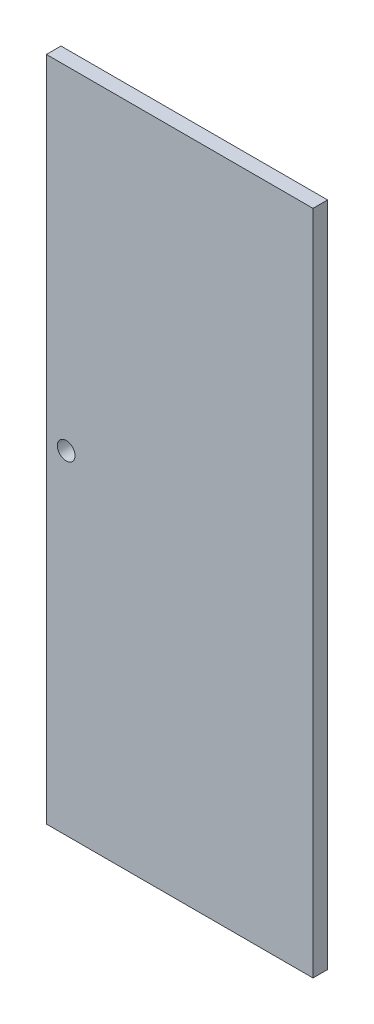
ISO-10303-21;
HEADER;
FILE_DESCRIPTION(('STEP AP214'),'2;1');
FILE_NAME('part.step','',(''),(''),'','','');
FILE_SCHEMA(('AUTOMOTIVE_DESIGN { 1 0 10303 214 1 1 1 1 }'));
ENDSEC;
DATA;
#1=APPLICATION_CONTEXT('core data for automotive mechanical design processes');
#2=APPLICATION_PROTOCOL_DEFINITION('international standard','automotive_design',2000,#1);
#3=PRODUCT_CONTEXT('',#1,'mechanical');
#4=PRODUCT('Part','Part','',(#3));
#5=PRODUCT_RELATED_PRODUCT_CATEGORY('part','',(#4));
#6=PRODUCT_DEFINITION_FORMATION('','',#4);
#7=PRODUCT_DEFINITION_CONTEXT('part definition',#1,'design');
#8=PRODUCT_DEFINITION('design','',#6,#7);
#9=PRODUCT_DEFINITION_SHAPE('','',#8);
#10=(LENGTH_UNIT() NAMED_UNIT(*) SI_UNIT(.MILLI.,.METRE.));
#11=(NAMED_UNIT(*) PLANE_ANGLE_UNIT() SI_UNIT($,.RADIAN.));
#12=(NAMED_UNIT(*) SI_UNIT($,.STERADIAN.) SOLID_ANGLE_UNIT());
#13=UNCERTAINTY_MEASURE_WITH_UNIT(LENGTH_MEASURE(1.E-05),#10,'distance_accuracy_value','');
#14=(GEOMETRIC_REPRESENTATION_CONTEXT(3) GLOBAL_UNCERTAINTY_ASSIGNED_CONTEXT((#13)) GLOBAL_UNIT_ASSIGNED_CONTEXT((#10,
#11,#12)) REPRESENTATION_CONTEXT('',''));
#15=CARTESIAN_POINT('',(0.,0.,0.));
#16=DIRECTION('',(0.,0.,1.));
#17=DIRECTION('',(1.,0.,0.));
#18=AXIS2_PLACEMENT_3D('',#15,#16,#17);
#19=CARTESIAN_POINT('',(760.571038615179,2.39287616511286,44.45));
#20=DIRECTION('',(1.,0.,0.));
#21=DIRECTION('',(0.,0.,-1.));
#22=AXIS2_PLACEMENT_3D('',#19,#20,#21);
#23=PLANE('',#22);
#24=DIRECTION('',(0.,-1.,0.));
#25=VECTOR('',#24,1.);
#26=CARTESIAN_POINT('',(760.571038615179,2.39287616511286,0.));
#27=LINE('',#26,#25);
#28=CARTESIAN_POINT('',(760.571038615179,2034.39287616511,0.));
#29=VERTEX_POINT('',#28);
#30=CARTESIAN_POINT('',(760.571038615179,2.39287616511286,0.));
#31=VERTEX_POINT('',#30);
#32=EDGE_CURVE('E97',#29,#31,#27,.T.);
#33=ORIENTED_EDGE('',*,*,#32,.T.);
#34=DIRECTION('',(0.,0.,-1.));
#35=VECTOR('',#34,1.);
#36=CARTESIAN_POINT('',(760.571038615179,2.39287616511286,44.45));
#37=LINE('',#36,#35);
#38=CARTESIAN_POINT('',(760.571038615179,2.39287616511286,44.45));
#39=VERTEX_POINT('',#38);
#40=EDGE_CURVE('E11',#39,#31,#37,.T.);
#41=ORIENTED_EDGE('',*,*,#40,.F.);
#42=DIRECTION('',(0.,-1.,0.));
#43=VECTOR('',#42,1.);
#44=CARTESIAN_POINT('',(760.571038615179,2.39287616511286,44.45));
#45=LINE('',#44,#43);
#46=CARTESIAN_POINT('',(760.571038615179,2034.39287616511,44.45));
#47=VERTEX_POINT('',#46);
#48=EDGE_CURVE('E85',#47,#39,#45,.T.);
#49=ORIENTED_EDGE('',*,*,#48,.F.);
#50=DIRECTION('',(0.,0.,-1.));
#51=VECTOR('',#50,1.);
#52=CARTESIAN_POINT('',(760.571038615179,2034.39287616511,44.45));
#53=LINE('',#52,#51);
#54=EDGE_CURVE('E93',#47,#29,#53,.T.);
#55=ORIENTED_EDGE('',*,*,#54,.T.);
#56=EDGE_LOOP('',(#33,#41,#49,#55));
#57=FACE_BOUND('',#56,.T.);
#58=ADVANCED_FACE('F34',(#57),#23,.F.);
#59=CARTESIAN_POINT('',(760.571038615179,2.39287616511286,44.45));
#60=DIRECTION('',(0.,1.,0.));
#61=DIRECTION('',(0.,0.,1.));
#62=AXIS2_PLACEMENT_3D('',#59,#60,#61);
#63=PLANE('',#62);
#64=DIRECTION('',(1.,0.,0.));
#65=VECTOR('',#64,1.);
#66=CARTESIAN_POINT('',(760.571038615179,2.39287616511286,0.));
#67=LINE('',#66,#65);
#68=CARTESIAN_POINT('',(1573.37103861518,2.39287616511286,0.));
#69=VERTEX_POINT('',#68);
#70=EDGE_CURVE('E89',#31,#69,#67,.T.);
#71=ORIENTED_EDGE('',*,*,#70,.T.);
#72=DIRECTION('',(0.,0.,-1.));
#73=VECTOR('',#72,1.);
#74=CARTESIAN_POINT('',(1573.37103861518,2.39287616511286,44.45));
#75=LINE('',#74,#73);
#76=CARTESIAN_POINT('',(1573.37103861518,2.39287616511286,44.45));
#77=VERTEX_POINT('',#76);
#78=EDGE_CURVE('E42',#77,#69,#75,.T.);
#79=ORIENTED_EDGE('',*,*,#78,.F.);
#80=DIRECTION('',(1.,0.,0.));
#81=VECTOR('',#80,1.);
#82=CARTESIAN_POINT('',(760.571038615179,2.39287616511286,44.45));
#83=LINE('',#82,#81);
#84=EDGE_CURVE('E80',#39,#77,#83,.T.);
#85=ORIENTED_EDGE('',*,*,#84,.F.);
#86=ORIENTED_EDGE('',*,*,#40,.T.);
#87=EDGE_LOOP('',(#71,#79,#85,#86));
#88=FACE_BOUND('',#87,.T.);
#89=ADVANCED_FACE('F88',(#88),#63,.F.);
#90=CARTESIAN_POINT('',(1573.37103861518,2.39287616511286,44.45));
#91=DIRECTION('',(-1.,0.,0.));
#92=DIRECTION('',(0.,0.,1.));
#93=AXIS2_PLACEMENT_3D('',#90,#91,#92);
#94=PLANE('',#93);
#95=DIRECTION('',(0.,1.,0.));
#96=VECTOR('',#95,1.);
#97=CARTESIAN_POINT('',(1573.37103861518,2.39287616511286,0.));
#98=LINE('',#97,#96);
#99=CARTESIAN_POINT('',(1573.37103861518,2034.39287616511,0.));
#100=VERTEX_POINT('',#99);
#101=EDGE_CURVE('E67',#69,#100,#98,.T.);
#102=ORIENTED_EDGE('',*,*,#101,.T.);
#103=DIRECTION('',(0.,0.,-1.));
#104=VECTOR('',#103,1.);
#105=CARTESIAN_POINT('',(1573.37103861518,2034.39287616511,44.45));
#106=LINE('',#105,#104);
#107=CARTESIAN_POINT('',(1573.37103861518,2034.39287616511,44.45));
#108=VERTEX_POINT('',#107);
#109=EDGE_CURVE('E90',#108,#100,#106,.T.);
#110=ORIENTED_EDGE('',*,*,#109,.F.);
#111=DIRECTION('',(0.,1.,0.));
#112=VECTOR('',#111,1.);
#113=CARTESIAN_POINT('',(1573.37103861518,2.39287616511286,44.45));
#114=LINE('',#113,#112);
#115=EDGE_CURVE('E83',#77,#108,#114,.T.);
#116=ORIENTED_EDGE('',*,*,#115,.F.);
#117=ORIENTED_EDGE('',*,*,#78,.T.);
#118=EDGE_LOOP('',(#102,#110,#116,#117));
#119=FACE_BOUND('',#118,.T.);
#120=ADVANCED_FACE('F91',(#119),#94,.F.);
#121=CARTESIAN_POINT('',(760.571038615179,2034.39287616511,44.45));
#122=DIRECTION('',(0.,-1.,0.));
#123=DIRECTION('',(0.,0.,-1.));
#124=AXIS2_PLACEMENT_3D('',#121,#122,#123);
#125=PLANE('',#124);
#126=DIRECTION('',(-1.,0.,0.));
#127=VECTOR('',#126,1.);
#128=CARTESIAN_POINT('',(760.571038615179,2034.39287616511,0.));
#129=LINE('',#128,#127);
#130=EDGE_CURVE('E73',#100,#29,#129,.T.);
#131=ORIENTED_EDGE('',*,*,#130,.T.);
#132=ORIENTED_EDGE('',*,*,#54,.F.);
#133=DIRECTION('',(-1.,0.,0.));
#134=VECTOR('',#133,1.);
#135=CARTESIAN_POINT('',(760.571038615179,2034.39287616511,44.45));
#136=LINE('',#135,#134);
#137=EDGE_CURVE('E50',#108,#47,#136,.T.);
#138=ORIENTED_EDGE('',*,*,#137,.F.);
#139=ORIENTED_EDGE('',*,*,#109,.T.);
#140=EDGE_LOOP('',(#131,#132,#138,#139));
#141=FACE_BOUND('',#140,.T.);
#142=ADVANCED_FACE('F105',(#141),#125,.F.);
#143=CARTESIAN_POINT('',(0.,0.,44.45));
#144=DIRECTION('',(0.,0.,-1.));
#145=DIRECTION('',(-1.,0.,0.));
#146=AXIS2_PLACEMENT_3D('',#143,#144,#145);
#147=PLANE('',#146);
#148=CARTESIAN_POINT('',(820.896038615179,1018.39287616511,44.45));
#149=DIRECTION('',(0.,0.,1.));
#150=DIRECTION('',(1.,0.,0.));
#151=AXIS2_PLACEMENT_3D('',#148,#149,#150);
#152=CIRCLE('',#151,26.9874999999999);
#153=CARTESIAN_POINT('',(847.883538615179,1018.39287616511,44.45));
#154=VERTEX_POINT('',#153);
#155=EDGE_CURVE('E111',#154,#154,#152,.T.);
#156=ORIENTED_EDGE('',*,*,#155,.F.);
#157=EDGE_LOOP('',(#156));
#158=FACE_BOUND('',#157,.T.);
#159=ORIENTED_EDGE('',*,*,#48,.T.);
#160=ORIENTED_EDGE('',*,*,#84,.T.);
#161=ORIENTED_EDGE('',*,*,#115,.T.);
#162=ORIENTED_EDGE('',*,*,#137,.T.);
#163=EDGE_LOOP('',(#159,#160,#161,#162));
#164=FACE_BOUND('',#163,.T.);
#165=ADVANCED_FACE('F81',(#158,#164),#147,.F.);
#166=CARTESIAN_POINT('',(0.,0.,0.));
#167=DIRECTION('',(0.,0.,-1.));
#168=DIRECTION('',(-1.,0.,0.));
#169=AXIS2_PLACEMENT_3D('',#166,#167,#168);
#170=PLANE('',#169);
#171=CARTESIAN_POINT('',(820.896038615179,1018.39287616511,0.));
#172=DIRECTION('',(0.,0.,1.));
#173=DIRECTION('',(1.,0.,0.));
#174=AXIS2_PLACEMENT_3D('',#171,#172,#173);
#175=CIRCLE('',#174,26.9874999999999);
#176=CARTESIAN_POINT('',(847.883538615179,1018.39287616511,0.));
#177=VERTEX_POINT('',#176);
#178=EDGE_CURVE('E100',#177,#177,#175,.T.);
#179=ORIENTED_EDGE('',*,*,#178,.T.);
#180=EDGE_LOOP('',(#179));
#181=FACE_BOUND('',#180,.T.);
#182=ORIENTED_EDGE('',*,*,#32,.F.);
#183=ORIENTED_EDGE('',*,*,#130,.F.);
#184=ORIENTED_EDGE('',*,*,#101,.F.);
#185=ORIENTED_EDGE('',*,*,#70,.F.);
#186=EDGE_LOOP('',(#182,#183,#184,#185));
#187=FACE_BOUND('',#186,.T.);
#188=ADVANCED_FACE('F108',(#181,#187),#170,.T.);
#189=CARTESIAN_POINT('',(820.896038615179,1018.39287616511,0.));
#190=DIRECTION('',(0.,0.,1.));
#191=DIRECTION('',(1.,0.,0.));
#192=AXIS2_PLACEMENT_3D('',#189,#190,#191);
#193=CYLINDRICAL_SURFACE('',#192,26.9874999999999);
#194=ORIENTED_EDGE('',*,*,#178,.F.);
#195=EDGE_LOOP('',(#194));
#196=FACE_BOUND('',#195,.T.);
#197=ORIENTED_EDGE('',*,*,#155,.T.);
#198=EDGE_LOOP('',(#197));
#199=FACE_BOUND('',#198,.T.);
#200=ADVANCED_FACE('F118',(#196,#199),#193,.F.);
#201=CLOSED_SHELL('',(#58,#89,#120,#142,#165,#188,#200));
#202=MANIFOLD_SOLID_BREP('B2',#201);
#203=ADVANCED_BREP_SHAPE_REPRESENTATION('',(#18,#202),#14);
#204=SHAPE_DEFINITION_REPRESENTATION(#9,#203);
ENDSEC;
END-ISO-10303-21;
